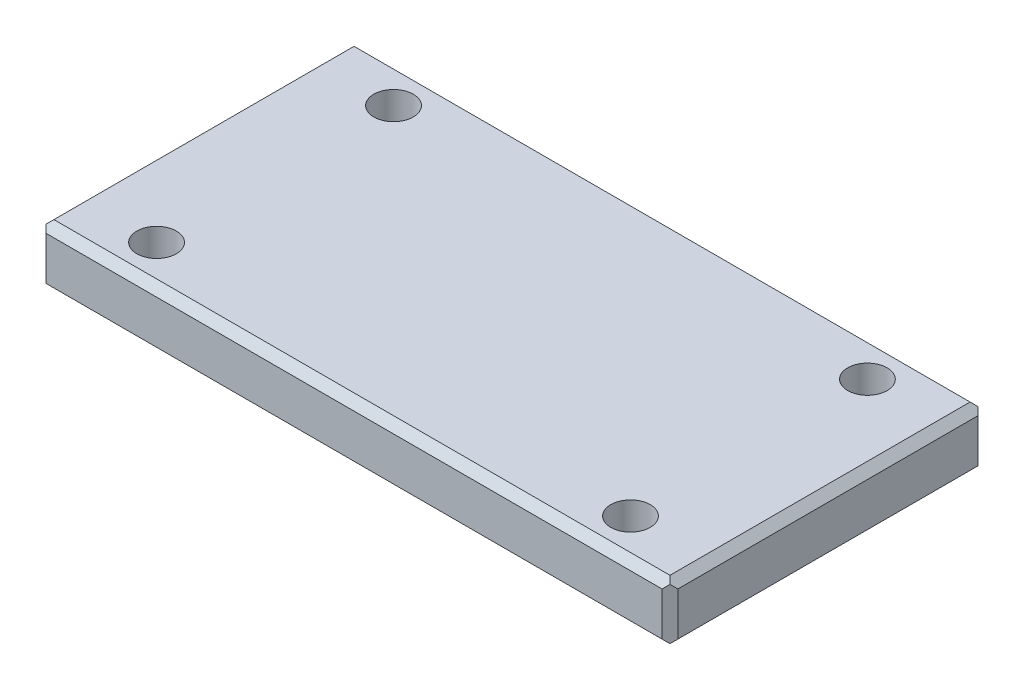
ISO-10303-21;
HEADER;
FILE_DESCRIPTION(('STEP AP214'),'2;1');
FILE_NAME('part.step','',(''),(''),'','','');
FILE_SCHEMA(('AUTOMOTIVE_DESIGN { 1 0 10303 214 1 1 1 1 }'));
ENDSEC;
DATA;
#1=APPLICATION_CONTEXT('core data for automotive mechanical design processes');
#2=APPLICATION_PROTOCOL_DEFINITION('international standard','automotive_design',2000,#1);
#3=PRODUCT_CONTEXT('',#1,'mechanical');
#4=PRODUCT('Part','Part','',(#3));
#5=PRODUCT_RELATED_PRODUCT_CATEGORY('part','',(#4));
#6=PRODUCT_DEFINITION_FORMATION('','',#4);
#7=PRODUCT_DEFINITION_CONTEXT('part definition',#1,'design');
#8=PRODUCT_DEFINITION('design','',#6,#7);
#9=PRODUCT_DEFINITION_SHAPE('','',#8);
#10=(LENGTH_UNIT() NAMED_UNIT(*) SI_UNIT(.MILLI.,.METRE.));
#11=(NAMED_UNIT(*) PLANE_ANGLE_UNIT() SI_UNIT($,.RADIAN.));
#12=(NAMED_UNIT(*) SI_UNIT($,.STERADIAN.) SOLID_ANGLE_UNIT());
#13=UNCERTAINTY_MEASURE_WITH_UNIT(LENGTH_MEASURE(1.E-05),#10,'distance_accuracy_value','');
#14=(GEOMETRIC_REPRESENTATION_CONTEXT(3) GLOBAL_UNCERTAINTY_ASSIGNED_CONTEXT((#13)) GLOBAL_UNIT_ASSIGNED_CONTEXT((#10,
#11,#12)) REPRESENTATION_CONTEXT('',''));
#15=CARTESIAN_POINT('',(0.,0.,0.));
#16=DIRECTION('',(0.,0.,1.));
#17=DIRECTION('',(1.,0.,0.));
#18=AXIS2_PLACEMENT_3D('',#15,#16,#17);
#19=CARTESIAN_POINT('',(0.,0.1875,0.));
#20=DIRECTION('',(0.,-1.,0.));
#21=DIRECTION('',(0.,0.,-1.));
#22=AXIS2_PLACEMENT_3D('',#19,#20,#21);
#23=PLANE('',#22);
#24=DIRECTION('',(1.,0.,0.));
#25=VECTOR('',#24,1.);
#26=CARTESIAN_POINT('',(0.,0.1875,0.950000000000004));
#27=LINE('',#26,#25);
#28=CARTESIAN_POINT('',(-1.95000000000003,0.1875,0.950000000000008));
#29=VERTEX_POINT('',#28);
#30=CARTESIAN_POINT('',(1.94999999999997,0.1875,0.950000000000001));
#31=VERTEX_POINT('',#30);
#32=EDGE_CURVE('E207',#29,#31,#27,.T.);
#33=ORIENTED_EDGE('',*,*,#32,.T.);
#34=DIRECTION('',(0.,0.,-1.));
#35=VECTOR('',#34,1.);
#36=CARTESIAN_POINT('',(1.94999999999997,0.1875,0.));
#37=LINE('',#36,#35);
#38=CARTESIAN_POINT('',(1.94999999999997,0.1875,-0.950000000000001));
#39=VERTEX_POINT('',#38);
#40=EDGE_CURVE('E214',#31,#39,#37,.T.);
#41=ORIENTED_EDGE('',*,*,#40,.T.);
#42=DIRECTION('',(-1.,0.,0.));
#43=VECTOR('',#42,1.);
#44=CARTESIAN_POINT('',(0.,0.1875,-0.949999999999997));
#45=LINE('',#44,#43);
#46=CARTESIAN_POINT('',(-1.95000000000003,0.1875,-0.949999999999994));
#47=VERTEX_POINT('',#46);
#48=EDGE_CURVE('E211',#39,#47,#45,.T.);
#49=ORIENTED_EDGE('',*,*,#48,.T.);
#50=DIRECTION('',(0.,0.,1.));
#51=VECTOR('',#50,1.);
#52=CARTESIAN_POINT('',(-1.95000000000003,0.1875,0.));
#53=LINE('',#52,#51);
#54=EDGE_CURVE('E209',#47,#29,#53,.T.);
#55=ORIENTED_EDGE('',*,*,#54,.T.);
#56=EDGE_LOOP('',(#33,#41,#49,#55));
#57=FACE_BOUND('',#56,.T.);
#58=CARTESIAN_POINT('',(-1.5,0.1875,-0.749999999999999));
#59=DIRECTION('',(0.,1.,0.));
#60=DIRECTION('',(0.,0.,1.));
#61=AXIS2_PLACEMENT_3D('',#58,#59,#60);
#62=CIRCLE('',#61,0.125);
#63=CARTESIAN_POINT('',(-1.5,0.1875,-0.624999999999999));
#64=VERTEX_POINT('',#63);
#65=EDGE_CURVE('E283',#64,#64,#62,.T.);
#66=ORIENTED_EDGE('',*,*,#65,.F.);
#67=EDGE_LOOP('',(#66));
#68=FACE_BOUND('',#67,.T.);
#69=CARTESIAN_POINT('',(1.5,0.1875,-0.75));
#70=DIRECTION('',(0.,1.,0.));
#71=DIRECTION('',(0.,0.,1.));
#72=AXIS2_PLACEMENT_3D('',#69,#70,#71);
#73=CIRCLE('',#72,0.125);
#74=CARTESIAN_POINT('',(1.5,0.1875,-0.625));
#75=VERTEX_POINT('',#74);
#76=EDGE_CURVE('E375',#75,#75,#73,.T.);
#77=ORIENTED_EDGE('',*,*,#76,.F.);
#78=EDGE_LOOP('',(#77));
#79=FACE_BOUND('',#78,.T.);
#80=CARTESIAN_POINT('',(1.5,0.1875,0.75));
#81=DIRECTION('',(0.,1.,0.));
#82=DIRECTION('',(0.,0.,1.));
#83=AXIS2_PLACEMENT_3D('',#80,#81,#82);
#84=CIRCLE('',#83,0.125);
#85=CARTESIAN_POINT('',(1.5,0.1875,0.875));
#86=VERTEX_POINT('',#85);
#87=EDGE_CURVE('E382',#86,#86,#84,.T.);
#88=ORIENTED_EDGE('',*,*,#87,.F.);
#89=EDGE_LOOP('',(#88));
#90=FACE_BOUND('',#89,.T.);
#91=CARTESIAN_POINT('',(-1.5,0.1875,0.750000000000001));
#92=DIRECTION('',(0.,1.,0.));
#93=DIRECTION('',(0.,0.,1.));
#94=AXIS2_PLACEMENT_3D('',#91,#92,#93);
#95=CIRCLE('',#94,0.125);
#96=CARTESIAN_POINT('',(-1.5,0.1875,0.875000000000001));
#97=VERTEX_POINT('',#96);
#98=EDGE_CURVE('E387',#97,#97,#95,.T.);
#99=ORIENTED_EDGE('',*,*,#98,.F.);
#100=EDGE_LOOP('',(#99));
#101=FACE_BOUND('',#100,.T.);
#102=ADVANCED_FACE('F42',(#57,#68,#79,#90,#101),#23,.F.);
#103=CARTESIAN_POINT('',(0.,-0.1875,0.));
#104=DIRECTION('',(0.,-1.,0.));
#105=DIRECTION('',(0.,0.,-1.));
#106=AXIS2_PLACEMENT_3D('',#103,#104,#105);
#107=PLANE('',#106);
#108=DIRECTION('',(-1.,0.,0.));
#109=VECTOR('',#108,1.);
#110=CARTESIAN_POINT('',(-2.00000000000003,-0.1875,0.950000000000007));
#111=LINE('',#110,#109);
#112=CARTESIAN_POINT('',(1.94999999999997,-0.1875,0.95));
#113=VERTEX_POINT('',#112);
#114=CARTESIAN_POINT('',(-1.95000000000003,-0.1875,0.950000000000007));
#115=VERTEX_POINT('',#114);
#116=EDGE_CURVE('E184',#113,#115,#111,.T.);
#117=ORIENTED_EDGE('',*,*,#116,.T.);
#118=DIRECTION('',(0.,0.,-1.));
#119=VECTOR('',#118,1.);
#120=CARTESIAN_POINT('',(-1.95000000000003,-0.1875,-0.999999999999994));
#121=LINE('',#120,#119);
#122=CARTESIAN_POINT('',(-1.95000000000003,-0.1875,-0.949999999999994));
#123=VERTEX_POINT('',#122);
#124=EDGE_CURVE('E161',#115,#123,#121,.T.);
#125=ORIENTED_EDGE('',*,*,#124,.T.);
#126=DIRECTION('',(1.,0.,0.));
#127=VECTOR('',#126,1.);
#128=CARTESIAN_POINT('',(1.99999999999997,-0.1875,-0.95));
#129=LINE('',#128,#127);
#130=CARTESIAN_POINT('',(1.94999999999997,-0.1875,-0.95));
#131=VERTEX_POINT('',#130);
#132=EDGE_CURVE('E171',#123,#131,#129,.T.);
#133=ORIENTED_EDGE('',*,*,#132,.T.);
#134=DIRECTION('',(0.,0.,1.));
#135=VECTOR('',#134,1.);
#136=CARTESIAN_POINT('',(1.94999999999997,-0.1875,1.));
#137=LINE('',#136,#135);
#138=EDGE_CURVE('E178',#131,#113,#137,.T.);
#139=ORIENTED_EDGE('',*,*,#138,.T.);
#140=EDGE_LOOP('',(#117,#125,#133,#139));
#141=FACE_BOUND('',#140,.T.);
#142=CARTESIAN_POINT('',(1.5,-0.1875,0.75));
#143=DIRECTION('',(0.,1.,0.));
#144=DIRECTION('',(0.,0.,1.));
#145=AXIS2_PLACEMENT_3D('',#142,#143,#144);
#146=CIRCLE('',#145,0.125);
#147=CARTESIAN_POINT('',(1.5,-0.1875,0.875));
#148=VERTEX_POINT('',#147);
#149=EDGE_CURVE('E384',#148,#148,#146,.T.);
#150=ORIENTED_EDGE('',*,*,#149,.T.);
#151=EDGE_LOOP('',(#150));
#152=FACE_BOUND('',#151,.T.);
#153=CARTESIAN_POINT('',(-1.5,-0.1875,-0.749999999999999));
#154=DIRECTION('',(0.,1.,0.));
#155=DIRECTION('',(0.,0.,1.));
#156=AXIS2_PLACEMENT_3D('',#153,#154,#155);
#157=CIRCLE('',#156,0.125);
#158=CARTESIAN_POINT('',(-1.5,-0.1875,-0.624999999999999));
#159=VERTEX_POINT('',#158);
#160=EDGE_CURVE('E373',#159,#159,#157,.T.);
#161=ORIENTED_EDGE('',*,*,#160,.T.);
#162=EDGE_LOOP('',(#161));
#163=FACE_BOUND('',#162,.T.);
#164=CARTESIAN_POINT('',(1.5,-0.1875,-0.75));
#165=DIRECTION('',(0.,1.,0.));
#166=DIRECTION('',(0.,0.,1.));
#167=AXIS2_PLACEMENT_3D('',#164,#165,#166);
#168=CIRCLE('',#167,0.125);
#169=CARTESIAN_POINT('',(1.5,-0.1875,-0.625));
#170=VERTEX_POINT('',#169);
#171=EDGE_CURVE('E378',#170,#170,#168,.T.);
#172=ORIENTED_EDGE('',*,*,#171,.T.);
#173=EDGE_LOOP('',(#172));
#174=FACE_BOUND('',#173,.T.);
#175=CARTESIAN_POINT('',(-1.5,-0.1875,0.750000000000001));
#176=DIRECTION('',(0.,1.,0.));
#177=DIRECTION('',(0.,0.,1.));
#178=AXIS2_PLACEMENT_3D('',#175,#176,#177);
#179=CIRCLE('',#178,0.125);
#180=CARTESIAN_POINT('',(-1.5,-0.1875,0.875000000000001));
#181=VERTEX_POINT('',#180);
#182=EDGE_CURVE('E223',#181,#181,#179,.T.);
#183=ORIENTED_EDGE('',*,*,#182,.T.);
#184=EDGE_LOOP('',(#183));
#185=FACE_BOUND('',#184,.T.);
#186=ADVANCED_FACE('F181',(#141,#152,#163,#174,#185),#107,.T.);
#187=CARTESIAN_POINT('',(-2.00000000000003,0.1875,-0.999999999999994));
#188=DIRECTION('',(1.,0.,0.));
#189=DIRECTION('',(0.,0.,-1.));
#190=AXIS2_PLACEMENT_3D('',#187,#188,#189);
#191=PLANE('',#190);
#192=DIRECTION('',(0.,0.,1.));
#193=VECTOR('',#192,1.);
#194=CARTESIAN_POINT('',(-2.00000000000003,-0.137499999999999,1.00000000000001));
#195=LINE('',#194,#193);
#196=CARTESIAN_POINT('',(-2.00000000000003,-0.137499999999999,-0.949999999999993));
#197=VERTEX_POINT('',#196);
#198=CARTESIAN_POINT('',(-2.00000000000003,-0.137499999999999,0.950000000000007));
#199=VERTEX_POINT('',#198);
#200=EDGE_CURVE('E179',#197,#199,#195,.T.);
#201=ORIENTED_EDGE('',*,*,#200,.T.);
#202=DIRECTION('',(0.,1.,0.));
#203=VECTOR('',#202,1.);
#204=CARTESIAN_POINT('',(-2.00000000000003,0.1875,0.950000000000007));
#205=LINE('',#204,#203);
#206=CARTESIAN_POINT('',(-2.00000000000003,0.1375,0.950000000000007));
#207=VERTEX_POINT('',#206);
#208=EDGE_CURVE('E64',#199,#207,#205,.T.);
#209=ORIENTED_EDGE('',*,*,#208,.T.);
#210=DIRECTION('',(0.,0.,-1.));
#211=VECTOR('',#210,1.);
#212=CARTESIAN_POINT('',(-2.00000000000003,0.1375,-0.999999999999994));
#213=LINE('',#212,#211);
#214=CARTESIAN_POINT('',(-2.00000000000003,0.1375,-0.949999999999993));
#215=VERTEX_POINT('',#214);
#216=EDGE_CURVE('E279',#207,#215,#213,.T.);
#217=ORIENTED_EDGE('',*,*,#216,.T.);
#218=DIRECTION('',(0.,-1.,0.));
#219=VECTOR('',#218,1.);
#220=CARTESIAN_POINT('',(-2.00000000000003,0.1875,-0.949999999999993));
#221=LINE('',#220,#219);
#222=EDGE_CURVE('E274',#215,#197,#221,.T.);
#223=ORIENTED_EDGE('',*,*,#222,.T.);
#224=EDGE_LOOP('',(#201,#209,#217,#223));
#225=FACE_BOUND('',#224,.T.);
#226=ADVANCED_FACE('F278',(#225),#191,.F.);
#227=CARTESIAN_POINT('',(1.99999999999997,0.1875,1.));
#228=DIRECTION('',(0.,0.,-1.));
#229=DIRECTION('',(-1.,0.,0.));
#230=AXIS2_PLACEMENT_3D('',#227,#228,#229);
#231=PLANE('',#230);
#232=DIRECTION('',(1.,0.,0.));
#233=VECTOR('',#232,1.);
#234=CARTESIAN_POINT('',(1.99999999999997,-0.137499999999999,1.));
#235=LINE('',#234,#233);
#236=CARTESIAN_POINT('',(-1.95000000000003,-0.137499999999999,1.00000000000001));
#237=VERTEX_POINT('',#236);
#238=CARTESIAN_POINT('',(1.94999999999997,-0.137499999999999,1.));
#239=VERTEX_POINT('',#238);
#240=EDGE_CURVE('E188',#237,#239,#235,.T.);
#241=ORIENTED_EDGE('',*,*,#240,.T.);
#242=DIRECTION('',(0.,1.,0.));
#243=VECTOR('',#242,1.);
#244=CARTESIAN_POINT('',(1.94999999999997,0.1875,1.));
#245=LINE('',#244,#243);
#246=CARTESIAN_POINT('',(1.94999999999997,0.1375,1.));
#247=VERTEX_POINT('',#246);
#248=EDGE_CURVE('E248',#239,#247,#245,.T.);
#249=ORIENTED_EDGE('',*,*,#248,.T.);
#250=DIRECTION('',(-1.,0.,0.));
#251=VECTOR('',#250,1.);
#252=CARTESIAN_POINT('',(1.99999999999997,0.1375,1.));
#253=LINE('',#252,#251);
#254=CARTESIAN_POINT('',(-1.95000000000003,0.1375,1.00000000000001));
#255=VERTEX_POINT('',#254);
#256=EDGE_CURVE('E185',#247,#255,#253,.T.);
#257=ORIENTED_EDGE('',*,*,#256,.T.);
#258=DIRECTION('',(0.,-1.,0.));
#259=VECTOR('',#258,1.);
#260=CARTESIAN_POINT('',(-1.95000000000003,0.1875,1.00000000000001));
#261=LINE('',#260,#259);
#262=EDGE_CURVE('E245',#255,#237,#261,.T.);
#263=ORIENTED_EDGE('',*,*,#262,.T.);
#264=EDGE_LOOP('',(#241,#249,#257,#263));
#265=FACE_BOUND('',#264,.T.);
#266=ADVANCED_FACE('F338',(#265),#231,.F.);
#267=CARTESIAN_POINT('',(1.99999999999997,0.1875,-1.));
#268=DIRECTION('',(-1.,0.,0.));
#269=DIRECTION('',(0.,0.,1.));
#270=AXIS2_PLACEMENT_3D('',#267,#268,#269);
#271=PLANE('',#270);
#272=DIRECTION('',(0.,0.,1.));
#273=VECTOR('',#272,1.);
#274=CARTESIAN_POINT('',(1.99999999999997,0.1375,-1.));
#275=LINE('',#274,#273);
#276=CARTESIAN_POINT('',(1.99999999999997,0.1375,-0.950000000000001));
#277=VERTEX_POINT('',#276);
#278=CARTESIAN_POINT('',(1.99999999999997,0.1375,0.950000000000001));
#279=VERTEX_POINT('',#278);
#280=EDGE_CURVE('E195',#277,#279,#275,.T.);
#281=ORIENTED_EDGE('',*,*,#280,.T.);
#282=DIRECTION('',(0.,-1.,0.));
#283=VECTOR('',#282,1.);
#284=CARTESIAN_POINT('',(1.99999999999997,0.1875,0.950000000000001));
#285=LINE('',#284,#283);
#286=CARTESIAN_POINT('',(1.99999999999997,-0.137499999999999,0.950000000000001));
#287=VERTEX_POINT('',#286);
#288=EDGE_CURVE('E234',#279,#287,#285,.T.);
#289=ORIENTED_EDGE('',*,*,#288,.T.);
#290=DIRECTION('',(0.,0.,-1.));
#291=VECTOR('',#290,1.);
#292=CARTESIAN_POINT('',(1.99999999999997,-0.137499999999999,-1.));
#293=LINE('',#292,#291);
#294=CARTESIAN_POINT('',(1.99999999999997,-0.137499999999999,-0.950000000000001));
#295=VERTEX_POINT('',#294);
#296=EDGE_CURVE('E198',#287,#295,#293,.T.);
#297=ORIENTED_EDGE('',*,*,#296,.T.);
#298=DIRECTION('',(0.,1.,0.));
#299=VECTOR('',#298,1.);
#300=CARTESIAN_POINT('',(1.99999999999997,0.1875,-0.950000000000001));
#301=LINE('',#300,#299);
#302=EDGE_CURVE('E217',#295,#277,#301,.T.);
#303=ORIENTED_EDGE('',*,*,#302,.T.);
#304=EDGE_LOOP('',(#281,#289,#297,#303));
#305=FACE_BOUND('',#304,.T.);
#306=ADVANCED_FACE('F327',(#305),#271,.F.);
#307=CARTESIAN_POINT('',(1.99999999999997,0.1875,-1.));
#308=DIRECTION('',(0.,0.,1.));
#309=DIRECTION('',(1.,0.,0.));
#310=AXIS2_PLACEMENT_3D('',#307,#308,#309);
#311=PLANE('',#310);
#312=DIRECTION('',(1.,0.,0.));
#313=VECTOR('',#312,1.);
#314=CARTESIAN_POINT('',(1.99999999999997,0.1375,-1.));
#315=LINE('',#314,#313);
#316=CARTESIAN_POINT('',(-1.95000000000003,0.1375,-0.999999999999994));
#317=VERTEX_POINT('',#316);
#318=CARTESIAN_POINT('',(1.94999999999997,0.1375,-1.));
#319=VERTEX_POINT('',#318);
#320=EDGE_CURVE('E201',#317,#319,#315,.T.);
#321=ORIENTED_EDGE('',*,*,#320,.T.);
#322=DIRECTION('',(0.,-1.,0.));
#323=VECTOR('',#322,1.);
#324=CARTESIAN_POINT('',(1.94999999999997,0.1875,-1.));
#325=LINE('',#324,#323);
#326=CARTESIAN_POINT('',(1.94999999999997,-0.137499999999999,-1.));
#327=VERTEX_POINT('',#326);
#328=EDGE_CURVE('E260',#319,#327,#325,.T.);
#329=ORIENTED_EDGE('',*,*,#328,.T.);
#330=DIRECTION('',(-1.,0.,0.));
#331=VECTOR('',#330,1.);
#332=CARTESIAN_POINT('',(-2.00000000000003,-0.137499999999999,-0.999999999999994));
#333=LINE('',#332,#331);
#334=CARTESIAN_POINT('',(-1.95000000000003,-0.137499999999999,-0.999999999999994));
#335=VERTEX_POINT('',#334);
#336=EDGE_CURVE('E204',#327,#335,#333,.T.);
#337=ORIENTED_EDGE('',*,*,#336,.T.);
#338=DIRECTION('',(0.,1.,0.));
#339=VECTOR('',#338,1.);
#340=CARTESIAN_POINT('',(-1.95000000000003,0.1875,-0.999999999999994));
#341=LINE('',#340,#339);
#342=EDGE_CURVE('E258',#335,#317,#341,.T.);
#343=ORIENTED_EDGE('',*,*,#342,.T.);
#344=EDGE_LOOP('',(#321,#329,#337,#343));
#345=FACE_BOUND('',#344,.T.);
#346=ADVANCED_FACE('F320',(#345),#311,.F.);
#347=CARTESIAN_POINT('',(-1.5,0.1875,-0.749999999999999));
#348=DIRECTION('',(0.,-1.,0.));
#349=DIRECTION('',(0.,0.,-1.));
#350=AXIS2_PLACEMENT_3D('',#347,#348,#349);
#351=CYLINDRICAL_SURFACE('',#350,0.125);
#352=ORIENTED_EDGE('',*,*,#65,.T.);
#353=EDGE_LOOP('',(#352));
#354=FACE_BOUND('',#353,.T.);
#355=ORIENTED_EDGE('',*,*,#160,.F.);
#356=EDGE_LOOP('',(#355));
#357=FACE_BOUND('',#356,.T.);
#358=ADVANCED_FACE('F354',(#354,#357),#351,.F.);
#359=CARTESIAN_POINT('',(1.5,0.1875,-0.75));
#360=DIRECTION('',(0.,-1.,0.));
#361=DIRECTION('',(0.,0.,-1.));
#362=AXIS2_PLACEMENT_3D('',#359,#360,#361);
#363=CYLINDRICAL_SURFACE('',#362,0.125);
#364=ORIENTED_EDGE('',*,*,#76,.T.);
#365=EDGE_LOOP('',(#364));
#366=FACE_BOUND('',#365,.T.);
#367=ORIENTED_EDGE('',*,*,#171,.F.);
#368=EDGE_LOOP('',(#367));
#369=FACE_BOUND('',#368,.T.);
#370=ADVANCED_FACE('F361',(#366,#369),#363,.F.);
#371=CARTESIAN_POINT('',(1.5,0.1875,0.75));
#372=DIRECTION('',(0.,-1.,0.));
#373=DIRECTION('',(0.,0.,-1.));
#374=AXIS2_PLACEMENT_3D('',#371,#372,#373);
#375=CYLINDRICAL_SURFACE('',#374,0.125);
#376=ORIENTED_EDGE('',*,*,#87,.T.);
#377=EDGE_LOOP('',(#376));
#378=FACE_BOUND('',#377,.T.);
#379=ORIENTED_EDGE('',*,*,#149,.F.);
#380=EDGE_LOOP('',(#379));
#381=FACE_BOUND('',#380,.T.);
#382=ADVANCED_FACE('F366',(#378,#381),#375,.F.);
#383=CARTESIAN_POINT('',(-1.5,0.1875,0.750000000000001));
#384=DIRECTION('',(0.,-1.,0.));
#385=DIRECTION('',(0.,0.,-1.));
#386=AXIS2_PLACEMENT_3D('',#383,#384,#385);
#387=CYLINDRICAL_SURFACE('',#386,0.125);
#388=ORIENTED_EDGE('',*,*,#98,.T.);
#389=EDGE_LOOP('',(#388));
#390=FACE_BOUND('',#389,.T.);
#391=ORIENTED_EDGE('',*,*,#182,.F.);
#392=EDGE_LOOP('',(#391));
#393=FACE_BOUND('',#392,.T.);
#394=ADVANCED_FACE('F395',(#390,#393),#387,.F.);
#395=CARTESIAN_POINT('',(1.99999999999997,-0.137499999999999,-1.));
#396=DIRECTION('',(0.707106781186547,-0.707106781186547,0.));
#397=DIRECTION('',(0.,0.,1.));
#398=AXIS2_PLACEMENT_3D('',#395,#396,#397);
#399=PLANE('',#398);
#400=ORIENTED_EDGE('',*,*,#296,.F.);
#401=DIRECTION('',(0.577350269189625,0.577350269189625,-0.577350269189627));
#402=VECTOR('',#401,1.);
#403=CARTESIAN_POINT('',(2.64999999999997,0.512500000000002,0.299999999999997));
#404=LINE('',#403,#402);
#405=CARTESIAN_POINT('',(1.97499999999997,-0.1625,0.975000000000001));
#406=VERTEX_POINT('',#405);
#407=EDGE_CURVE('E239',#287,#406,#404,.F.);
#408=ORIENTED_EDGE('',*,*,#407,.T.);
#409=DIRECTION('',(-0.577350269189626,-0.577350269189626,-0.577350269189625));
#410=VECTOR('',#409,1.);
#411=CARTESIAN_POINT('',(1.3333333333333,-0.804166666666666,0.333333333333335));
#412=LINE('',#411,#410);
#413=EDGE_CURVE('E167',#113,#406,#412,.F.);
#414=ORIENTED_EDGE('',*,*,#413,.F.);
#415=ORIENTED_EDGE('',*,*,#138,.F.);
#416=DIRECTION('',(-0.577350269189625,-0.577350269189626,0.577350269189627));
#417=VECTOR('',#416,1.);
#418=CARTESIAN_POINT('',(1.99999999999997,-0.137499999999999,-1.));
#419=LINE('',#418,#417);
#420=CARTESIAN_POINT('',(1.97499999999997,-0.1625,-0.975000000000001));
#421=VERTEX_POINT('',#420);
#422=EDGE_CURVE('E175',#421,#131,#419,.T.);
#423=ORIENTED_EDGE('',*,*,#422,.F.);
#424=DIRECTION('',(-0.577350269189625,-0.577350269189625,-0.577350269189627));
#425=VECTOR('',#424,1.);
#426=CARTESIAN_POINT('',(1.9833333333333,-0.154166666666666,-0.966666666666667));
#427=LINE('',#426,#425);
#428=EDGE_CURVE('E237',#421,#295,#427,.F.);
#429=ORIENTED_EDGE('',*,*,#428,.T.);
#430=EDGE_LOOP('',(#400,#408,#414,#415,#423,#429));
#431=FACE_BOUND('',#430,.T.);
#432=ADVANCED_FACE('F289',(#431),#399,.T.);
#433=CARTESIAN_POINT('',(1.99999999999997,-0.137499999999999,-1.));
#434=DIRECTION('',(0.,-0.707106781186547,-0.707106781186547));
#435=DIRECTION('',(1.,0.,0.));
#436=AXIS2_PLACEMENT_3D('',#433,#434,#435);
#437=PLANE('',#436);
#438=ORIENTED_EDGE('',*,*,#336,.F.);
#439=DIRECTION('',(-0.577350269189625,0.577350269189627,-0.577350269189626));
#440=VECTOR('',#439,1.);
#441=CARTESIAN_POINT('',(1.96666666666663,-0.154166666666666,-0.983333333333334));
#442=LINE('',#441,#440);
#443=EDGE_CURVE('E265',#327,#421,#442,.F.);
#444=ORIENTED_EDGE('',*,*,#443,.T.);
#445=ORIENTED_EDGE('',*,*,#422,.T.);
#446=ORIENTED_EDGE('',*,*,#132,.F.);
#447=DIRECTION('',(-0.577350269189626,0.577350269189626,-0.577350269189625));
#448=VECTOR('',#447,1.);
#449=CARTESIAN_POINT('',(-0.666666666666701,-1.47083333333333,0.333333333333337));
#450=LINE('',#449,#448);
#451=CARTESIAN_POINT('',(-1.97500000000003,-0.1625,-0.974999999999993));
#452=VERTEX_POINT('',#451);
#453=EDGE_CURVE('E156',#452,#123,#450,.F.);
#454=ORIENTED_EDGE('',*,*,#453,.F.);
#455=DIRECTION('',(-0.577350269189624,-0.577350269189626,0.577350269189627));
#456=VECTOR('',#455,1.);
#457=CARTESIAN_POINT('',(-0.633333333333375,1.17916666666667,-2.31666666666666));
#458=LINE('',#457,#456);
#459=EDGE_CURVE('E263',#452,#335,#458,.F.);
#460=ORIENTED_EDGE('',*,*,#459,.T.);
#461=EDGE_LOOP('',(#438,#444,#445,#446,#454,#460));
#462=FACE_BOUND('',#461,.T.);
#463=ADVANCED_FACE('F173',(#462),#437,.T.);
#464=CARTESIAN_POINT('',(1.99999999999997,-0.137499999999999,1.));
#465=DIRECTION('',(0.,-0.707106781186547,0.707106781186547));
#466=DIRECTION('',(-1.,0.,0.));
#467=AXIS2_PLACEMENT_3D('',#464,#465,#466);
#468=PLANE('',#467);
#469=ORIENTED_EDGE('',*,*,#413,.T.);
#470=DIRECTION('',(0.577350269189625,-0.577350269189626,-0.577350269189627));
#471=VECTOR('',#470,1.);
#472=CARTESIAN_POINT('',(1.96666666666663,-0.154166666666666,0.983333333333334));
#473=LINE('',#472,#471);
#474=EDGE_CURVE('E243',#406,#239,#473,.F.);
#475=ORIENTED_EDGE('',*,*,#474,.T.);
#476=ORIENTED_EDGE('',*,*,#240,.F.);
#477=DIRECTION('',(0.577350269189619,0.57735026918963,0.577350269189629));
#478=VECTOR('',#477,1.);
#479=CARTESIAN_POINT('',(-0.633333333333401,1.17916666666666,2.31666666666666));
#480=LINE('',#479,#478);
#481=CARTESIAN_POINT('',(-1.97500000000003,-0.162499999999999,0.975000000000008));
#482=VERTEX_POINT('',#481);
#483=EDGE_CURVE('E241',#237,#482,#480,.F.);
#484=ORIENTED_EDGE('',*,*,#483,.T.);
#485=DIRECTION('',(0.577350269189625,-0.577350269189626,-0.577350269189627));
#486=VECTOR('',#485,1.);
#487=CARTESIAN_POINT('',(-0.6666666666667,-1.47083333333333,-0.333333333333328));
#488=LINE('',#487,#486);
#489=EDGE_CURVE('E168',#115,#482,#488,.F.);
#490=ORIENTED_EDGE('',*,*,#489,.F.);
#491=ORIENTED_EDGE('',*,*,#116,.F.);
#492=EDGE_LOOP('',(#469,#475,#476,#484,#490,#491));
#493=FACE_BOUND('',#492,.T.);
#494=ADVANCED_FACE('F292',(#493),#468,.T.);
#495=CARTESIAN_POINT('',(-2.00000000000003,-0.137499999999999,-0.999999999999994));
#496=DIRECTION('',(-0.707106781186547,-0.707106781186547,0.));
#497=DIRECTION('',(0.,0.,-1.));
#498=AXIS2_PLACEMENT_3D('',#495,#496,#497);
#499=PLANE('',#498);
#500=ORIENTED_EDGE('',*,*,#489,.T.);
#501=DIRECTION('',(0.577350269189623,-0.577350269189622,0.577350269189633));
#502=VECTOR('',#501,1.);
#503=CARTESIAN_POINT('',(-2.65000000000004,0.512500000000005,0.299999999999992));
#504=LINE('',#503,#502);
#505=EDGE_CURVE('E272',#482,#199,#504,.F.);
#506=ORIENTED_EDGE('',*,*,#505,.T.);
#507=ORIENTED_EDGE('',*,*,#200,.F.);
#508=DIRECTION('',(-0.577350269189625,0.577350269189625,0.577350269189628));
#509=VECTOR('',#508,1.);
#510=CARTESIAN_POINT('',(-1.98333333333337,-0.154166666666666,-0.96666666666666));
#511=LINE('',#510,#509);
#512=EDGE_CURVE('E164',#197,#452,#511,.F.);
#513=ORIENTED_EDGE('',*,*,#512,.T.);
#514=ORIENTED_EDGE('',*,*,#453,.T.);
#515=ORIENTED_EDGE('',*,*,#124,.F.);
#516=EDGE_LOOP('',(#500,#506,#507,#513,#514,#515));
#517=FACE_BOUND('',#516,.T.);
#518=ADVANCED_FACE('F159',(#517),#499,.T.);
#519=CARTESIAN_POINT('',(-1.95000000000003,0.1875,0.));
#520=DIRECTION('',(0.707106781186547,-0.707106781186547,0.));
#521=DIRECTION('',(0.,0.,1.));
#522=AXIS2_PLACEMENT_3D('',#519,#520,#521);
#523=PLANE('',#522);
#524=ORIENTED_EDGE('',*,*,#216,.F.);
#525=DIRECTION('',(0.577350269189623,0.577350269189622,0.577350269189633));
#526=VECTOR('',#525,1.);
#527=CARTESIAN_POINT('',(-2.28333333333337,-0.145833333333338,0.666666666666665));
#528=LINE('',#527,#526);
#529=CARTESIAN_POINT('',(-1.97500000000003,0.1625,0.975000000000008));
#530=VERTEX_POINT('',#529);
#531=EDGE_CURVE('E11',#207,#530,#528,.T.);
#532=ORIENTED_EDGE('',*,*,#531,.T.);
#533=DIRECTION('',(-0.577350269189625,-0.577350269189626,0.577350269189627));
#534=VECTOR('',#533,1.);
#535=CARTESIAN_POINT('',(-1.30000000000002,0.837500000000012,0.299999999999994));
#536=LINE('',#535,#534);
#537=EDGE_CURVE('E218',#29,#530,#536,.T.);
#538=ORIENTED_EDGE('',*,*,#537,.F.);
#539=ORIENTED_EDGE('',*,*,#54,.F.);
#540=DIRECTION('',(-0.577350269189626,-0.577350269189626,-0.577350269189625));
#541=VECTOR('',#540,1.);
#542=CARTESIAN_POINT('',(-1.63333333333337,0.504166666666665,-0.63333333333333));
#543=LINE('',#542,#541);
#544=CARTESIAN_POINT('',(-1.97500000000003,0.1625,-0.974999999999993));
#545=VERTEX_POINT('',#544);
#546=EDGE_CURVE('E229',#545,#47,#543,.F.);
#547=ORIENTED_EDGE('',*,*,#546,.F.);
#548=DIRECTION('',(-0.577350269189625,-0.577350269189625,0.577350269189628));
#549=VECTOR('',#548,1.);
#550=CARTESIAN_POINT('',(-2.28333333333337,-0.145833333333332,-0.66666666666666));
#551=LINE('',#550,#549);
#552=EDGE_CURVE('E51',#545,#215,#551,.T.);
#553=ORIENTED_EDGE('',*,*,#552,.T.);
#554=EDGE_LOOP('',(#524,#532,#538,#539,#547,#553));
#555=FACE_BOUND('',#554,.T.);
#556=ADVANCED_FACE('F300',(#555),#523,.F.);
#557=CARTESIAN_POINT('',(0.,0.1875,0.950000000000004));
#558=DIRECTION('',(0.,-0.707106781186547,-0.707106781186547));
#559=DIRECTION('',(1.,0.,0.));
#560=AXIS2_PLACEMENT_3D('',#557,#558,#559);
#561=PLANE('',#560);
#562=ORIENTED_EDGE('',*,*,#256,.F.);
#563=DIRECTION('',(0.577350269189625,0.577350269189626,-0.577350269189627));
#564=VECTOR('',#563,1.);
#565=CARTESIAN_POINT('',(1.33333333333331,-0.479166666666655,1.61666666666666));
#566=LINE('',#565,#564);
#567=CARTESIAN_POINT('',(1.97499999999997,0.1625,0.975000000000001));
#568=VERTEX_POINT('',#567);
#569=EDGE_CURVE('E252',#247,#568,#566,.T.);
#570=ORIENTED_EDGE('',*,*,#569,.T.);
#571=DIRECTION('',(-0.577350269189626,0.577350269189626,-0.577350269189625));
#572=VECTOR('',#571,1.);
#573=CARTESIAN_POINT('',(1.29999999999998,0.837499999999988,0.300000000000014));
#574=LINE('',#573,#572);
#575=EDGE_CURVE('E226',#31,#568,#574,.F.);
#576=ORIENTED_EDGE('',*,*,#575,.F.);
#577=ORIENTED_EDGE('',*,*,#32,.F.);
#578=ORIENTED_EDGE('',*,*,#537,.T.);
#579=DIRECTION('',(0.577350269189619,-0.57735026918963,0.577350269189629));
#580=VECTOR('',#579,1.);
#581=CARTESIAN_POINT('',(-1.33333333333337,-0.479166666666674,1.61666666666668));
#582=LINE('',#581,#580);
#583=EDGE_CURVE('E250',#530,#255,#582,.T.);
#584=ORIENTED_EDGE('',*,*,#583,.T.);
#585=EDGE_LOOP('',(#562,#570,#576,#577,#578,#584));
#586=FACE_BOUND('',#585,.T.);
#587=ADVANCED_FACE('F305',(#586),#561,.F.);
#588=CARTESIAN_POINT('',(0.,0.1875,-0.949999999999997));
#589=DIRECTION('',(0.,-0.707106781186547,0.707106781186547));
#590=DIRECTION('',(-1.,0.,0.));
#591=AXIS2_PLACEMENT_3D('',#588,#589,#590);
#592=PLANE('',#591);
#593=DIRECTION('',(0.577350269189625,-0.577350269189626,-0.577350269189627));
#594=VECTOR('',#593,1.);
#595=CARTESIAN_POINT('',(1.29999999999998,0.837499999999989,-0.30000000000001));
#596=LINE('',#595,#594);
#597=CARTESIAN_POINT('',(1.97499999999997,0.1625,-0.975000000000001));
#598=VERTEX_POINT('',#597);
#599=EDGE_CURVE('E224',#598,#39,#596,.F.);
#600=ORIENTED_EDGE('',*,*,#599,.F.);
#601=DIRECTION('',(-0.577350269189625,-0.577350269189627,-0.577350269189626));
#602=VECTOR('',#601,1.);
#603=CARTESIAN_POINT('',(1.33333333333331,-0.479166666666654,-1.61666666666665));
#604=LINE('',#603,#602);
#605=EDGE_CURVE('E269',#598,#319,#604,.T.);
#606=ORIENTED_EDGE('',*,*,#605,.T.);
#607=ORIENTED_EDGE('',*,*,#320,.F.);
#608=DIRECTION('',(-0.577350269189624,0.577350269189626,0.577350269189627));
#609=VECTOR('',#608,1.);
#610=CARTESIAN_POINT('',(-1.33333333333336,-0.479166666666677,-1.61666666666667));
#611=LINE('',#610,#609);
#612=EDGE_CURVE('E267',#317,#545,#611,.T.);
#613=ORIENTED_EDGE('',*,*,#612,.T.);
#614=ORIENTED_EDGE('',*,*,#546,.T.);
#615=ORIENTED_EDGE('',*,*,#48,.F.);
#616=EDGE_LOOP('',(#600,#606,#607,#613,#614,#615));
#617=FACE_BOUND('',#616,.T.);
#618=ADVANCED_FACE('F316',(#617),#592,.F.);
#619=CARTESIAN_POINT('',(1.94999999999997,0.1875,0.));
#620=DIRECTION('',(-0.707106781186547,-0.707106781186547,0.));
#621=DIRECTION('',(0.,0.,-1.));
#622=AXIS2_PLACEMENT_3D('',#619,#620,#621);
#623=PLANE('',#622);
#624=ORIENTED_EDGE('',*,*,#575,.T.);
#625=DIRECTION('',(0.577350269189625,-0.577350269189625,-0.577350269189627));
#626=VECTOR('',#625,1.);
#627=CARTESIAN_POINT('',(2.2833333333333,-0.145833333333334,0.666666666666666));
#628=LINE('',#627,#626);
#629=EDGE_CURVE('E256',#568,#279,#628,.T.);
#630=ORIENTED_EDGE('',*,*,#629,.T.);
#631=ORIENTED_EDGE('',*,*,#280,.F.);
#632=DIRECTION('',(-0.577350269189625,0.577350269189625,-0.577350269189627));
#633=VECTOR('',#632,1.);
#634=CARTESIAN_POINT('',(2.2833333333333,-0.145833333333334,-0.666666666666666));
#635=LINE('',#634,#633);
#636=EDGE_CURVE('E254',#277,#598,#635,.T.);
#637=ORIENTED_EDGE('',*,*,#636,.T.);
#638=ORIENTED_EDGE('',*,*,#599,.T.);
#639=ORIENTED_EDGE('',*,*,#40,.F.);
#640=EDGE_LOOP('',(#624,#630,#631,#637,#638,#639));
#641=FACE_BOUND('',#640,.T.);
#642=ADVANCED_FACE('F331',(#641),#623,.F.);
#643=CARTESIAN_POINT('',(1.99999999999997,0.1875,0.950000000000001));
#644=DIRECTION('',(-0.707106781186549,0.,-0.707106781186546));
#645=DIRECTION('',(0.,-1.,0.));
#646=AXIS2_PLACEMENT_3D('',#643,#644,#645);
#647=PLANE('',#646);
#648=ORIENTED_EDGE('',*,*,#569,.F.);
#649=ORIENTED_EDGE('',*,*,#248,.F.);
#650=ORIENTED_EDGE('',*,*,#474,.F.);
#651=ORIENTED_EDGE('',*,*,#407,.F.);
#652=ORIENTED_EDGE('',*,*,#288,.F.);
#653=ORIENTED_EDGE('',*,*,#629,.F.);
#654=EDGE_LOOP('',(#648,#649,#650,#651,#652,#653));
#655=FACE_BOUND('',#654,.T.);
#656=ADVANCED_FACE('F335',(#655),#647,.F.);
#657=CARTESIAN_POINT('',(1.94999999999997,0.1875,-1.));
#658=DIRECTION('',(-0.707106781186548,0.,0.707106781186547));
#659=DIRECTION('',(0.,-1.,0.));
#660=AXIS2_PLACEMENT_3D('',#657,#658,#659);
#661=PLANE('',#660);
#662=ORIENTED_EDGE('',*,*,#636,.F.);
#663=ORIENTED_EDGE('',*,*,#302,.F.);
#664=ORIENTED_EDGE('',*,*,#428,.F.);
#665=ORIENTED_EDGE('',*,*,#443,.F.);
#666=ORIENTED_EDGE('',*,*,#328,.F.);
#667=ORIENTED_EDGE('',*,*,#605,.F.);
#668=EDGE_LOOP('',(#662,#663,#664,#665,#666,#667));
#669=FACE_BOUND('',#668,.T.);
#670=ADVANCED_FACE('F323',(#669),#661,.F.);
#671=CARTESIAN_POINT('',(-1.95000000000003,0.1875,1.00000000000001));
#672=DIRECTION('',(0.707106781186554,0.,-0.707106781186541));
#673=DIRECTION('',(0.,-1.,0.));
#674=AXIS2_PLACEMENT_3D('',#671,#672,#673);
#675=PLANE('',#674);
#676=ORIENTED_EDGE('',*,*,#531,.F.);
#677=ORIENTED_EDGE('',*,*,#208,.F.);
#678=ORIENTED_EDGE('',*,*,#505,.F.);
#679=ORIENTED_EDGE('',*,*,#483,.F.);
#680=ORIENTED_EDGE('',*,*,#262,.F.);
#681=ORIENTED_EDGE('',*,*,#583,.F.);
#682=EDGE_LOOP('',(#676,#677,#678,#679,#680,#681));
#683=FACE_BOUND('',#682,.T.);
#684=ADVANCED_FACE('F296',(#683),#675,.F.);
#685=CARTESIAN_POINT('',(-2.00000000000003,0.1875,-0.949999999999993));
#686=DIRECTION('',(0.70710678118655,0.,0.707106781186545));
#687=DIRECTION('',(0.,-1.,0.));
#688=AXIS2_PLACEMENT_3D('',#685,#686,#687);
#689=PLANE('',#688);
#690=ORIENTED_EDGE('',*,*,#612,.F.);
#691=ORIENTED_EDGE('',*,*,#342,.F.);
#692=ORIENTED_EDGE('',*,*,#459,.F.);
#693=ORIENTED_EDGE('',*,*,#512,.F.);
#694=ORIENTED_EDGE('',*,*,#222,.F.);
#695=ORIENTED_EDGE('',*,*,#552,.F.);
#696=EDGE_LOOP('',(#690,#691,#692,#693,#694,#695));
#697=FACE_BOUND('',#696,.T.);
#698=ADVANCED_FACE('F45',(#697),#689,.F.);
#699=CLOSED_SHELL('',(#102,#186,#226,#266,#306,#346,#358,#370,#382,#394,#432,#463,#494,#518,
#556,#587,#618,#642,#656,#670,#684,#698));
#700=MANIFOLD_SOLID_BREP('B2',#699);
#701=ADVANCED_BREP_SHAPE_REPRESENTATION('',(#18,#700),#14);
#702=SHAPE_DEFINITION_REPRESENTATION(#9,#701);
ENDSEC;
END-ISO-10303-21;
